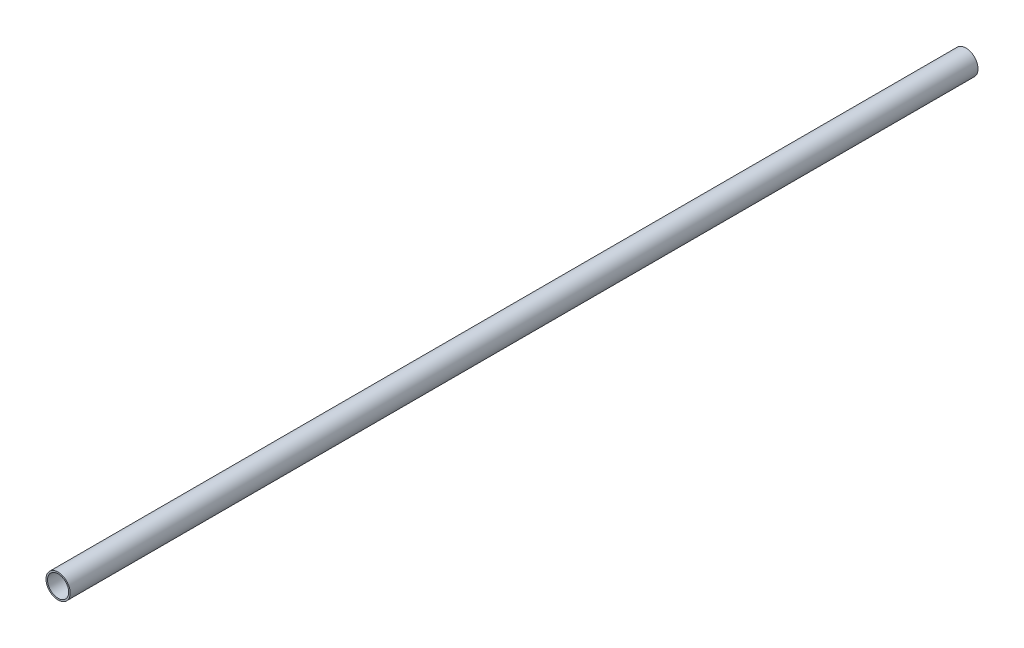
ISO-10303-21;
HEADER;
FILE_DESCRIPTION(('STEP AP214'),'2;1');
FILE_NAME('part.step','',(''),(''),'','','');
FILE_SCHEMA(('AUTOMOTIVE_DESIGN { 1 0 10303 214 1 1 1 1 }'));
ENDSEC;
DATA;
#1=APPLICATION_CONTEXT('core data for automotive mechanical design processes');
#2=APPLICATION_PROTOCOL_DEFINITION('international standard','automotive_design',2000,#1);
#3=PRODUCT_CONTEXT('',#1,'mechanical');
#4=PRODUCT('Part','Part','',(#3));
#5=PRODUCT_RELATED_PRODUCT_CATEGORY('part','',(#4));
#6=PRODUCT_DEFINITION_FORMATION('','',#4);
#7=PRODUCT_DEFINITION_CONTEXT('part definition',#1,'design');
#8=PRODUCT_DEFINITION('design','',#6,#7);
#9=PRODUCT_DEFINITION_SHAPE('','',#8);
#10=(LENGTH_UNIT() NAMED_UNIT(*) SI_UNIT(.MILLI.,.METRE.));
#11=(NAMED_UNIT(*) PLANE_ANGLE_UNIT() SI_UNIT($,.RADIAN.));
#12=(NAMED_UNIT(*) SI_UNIT($,.STERADIAN.) SOLID_ANGLE_UNIT());
#13=UNCERTAINTY_MEASURE_WITH_UNIT(LENGTH_MEASURE(1.E-05),#10,'distance_accuracy_value','');
#14=(GEOMETRIC_REPRESENTATION_CONTEXT(3) GLOBAL_UNCERTAINTY_ASSIGNED_CONTEXT((#13)) GLOBAL_UNIT_ASSIGNED_CONTEXT((#10,
#11,#12)) REPRESENTATION_CONTEXT('',''));
#15=CARTESIAN_POINT('',(0.,0.,0.));
#16=DIRECTION('',(0.,0.,1.));
#17=DIRECTION('',(1.,0.,0.));
#18=AXIS2_PLACEMENT_3D('',#15,#16,#17);
#19=CARTESIAN_POINT('',(0.,0.,300.));
#20=DIRECTION('',(0.,0.,1.));
#21=DIRECTION('',(1.,0.,0.));
#22=AXIS2_PLACEMENT_3D('',#19,#20,#21);
#23=PLANE('',#22);
#24=CARTESIAN_POINT('',(0.,0.,300.));
#25=DIRECTION('',(0.,0.,1.));
#26=DIRECTION('',(1.,0.,0.));
#27=AXIS2_PLACEMENT_3D('',#24,#25,#26);
#28=CIRCLE('',#27,4.);
#29=CARTESIAN_POINT('',(4.,0.,300.));
#30=VERTEX_POINT('',#29);
#31=EDGE_CURVE('E10',#30,#30,#28,.T.);
#32=ORIENTED_EDGE('',*,*,#31,.T.);
#33=EDGE_LOOP('',(#32));
#34=FACE_BOUND('',#33,.T.);
#35=CARTESIAN_POINT('',(0.,0.,300.));
#36=DIRECTION('',(0.,0.,1.));
#37=DIRECTION('',(1.,0.,0.));
#38=AXIS2_PLACEMENT_3D('',#35,#36,#37);
#39=CIRCLE('',#38,3.5);
#40=CARTESIAN_POINT('',(3.5,0.,300.));
#41=VERTEX_POINT('',#40);
#42=EDGE_CURVE('E54',#41,#41,#39,.T.);
#43=ORIENTED_EDGE('',*,*,#42,.F.);
#44=EDGE_LOOP('',(#43));
#45=FACE_BOUND('',#44,.T.);
#46=ADVANCED_FACE('F41',(#34,#45),#23,.T.);
#47=CARTESIAN_POINT('',(0.,0.,0.));
#48=DIRECTION('',(0.,0.,1.));
#49=DIRECTION('',(1.,0.,0.));
#50=AXIS2_PLACEMENT_3D('',#47,#48,#49);
#51=PLANE('',#50);
#52=CARTESIAN_POINT('',(0.,0.,0.));
#53=DIRECTION('',(0.,0.,1.));
#54=DIRECTION('',(1.,0.,0.));
#55=AXIS2_PLACEMENT_3D('',#52,#53,#54);
#56=CIRCLE('',#55,4.);
#57=CARTESIAN_POINT('',(4.,0.,0.));
#58=VERTEX_POINT('',#57);
#59=EDGE_CURVE('E45',#58,#58,#56,.T.);
#60=ORIENTED_EDGE('',*,*,#59,.F.);
#61=EDGE_LOOP('',(#60));
#62=FACE_BOUND('',#61,.T.);
#63=CARTESIAN_POINT('',(0.,0.,0.));
#64=DIRECTION('',(0.,0.,1.));
#65=DIRECTION('',(1.,0.,0.));
#66=AXIS2_PLACEMENT_3D('',#63,#64,#65);
#67=CIRCLE('',#66,3.5);
#68=CARTESIAN_POINT('',(3.5,0.,0.));
#69=VERTEX_POINT('',#68);
#70=EDGE_CURVE('E56',#69,#69,#67,.T.);
#71=ORIENTED_EDGE('',*,*,#70,.T.);
#72=EDGE_LOOP('',(#71));
#73=FACE_BOUND('',#72,.T.);
#74=ADVANCED_FACE('F68',(#62,#73),#51,.F.);
#75=CARTESIAN_POINT('',(0.,0.,300.));
#76=DIRECTION('',(0.,0.,-1.));
#77=DIRECTION('',(-1.,0.,0.));
#78=AXIS2_PLACEMENT_3D('',#75,#76,#77);
#79=CYLINDRICAL_SURFACE('',#78,4.);
#80=ORIENTED_EDGE('',*,*,#31,.F.);
#81=EDGE_LOOP('',(#80));
#82=FACE_BOUND('',#81,.T.);
#83=ORIENTED_EDGE('',*,*,#59,.T.);
#84=EDGE_LOOP('',(#83));
#85=FACE_BOUND('',#84,.T.);
#86=ADVANCED_FACE('F43',(#82,#85),#79,.T.);
#87=CARTESIAN_POINT('',(0.,0.,300.));
#88=DIRECTION('',(0.,0.,-1.));
#89=DIRECTION('',(-1.,0.,0.));
#90=AXIS2_PLACEMENT_3D('',#87,#88,#89);
#91=CYLINDRICAL_SURFACE('',#90,3.5);
#92=ORIENTED_EDGE('',*,*,#42,.T.);
#93=EDGE_LOOP('',(#92));
#94=FACE_BOUND('',#93,.T.);
#95=ORIENTED_EDGE('',*,*,#70,.F.);
#96=EDGE_LOOP('',(#95));
#97=FACE_BOUND('',#96,.T.);
#98=ADVANCED_FACE('F64',(#94,#97),#91,.F.);
#99=CLOSED_SHELL('',(#46,#74,#86,#98));
#100=MANIFOLD_SOLID_BREP('B2',#99);
#101=ADVANCED_BREP_SHAPE_REPRESENTATION('',(#18,#100),#14);
#102=SHAPE_DEFINITION_REPRESENTATION(#9,#101);
ENDSEC;
END-ISO-10303-21;
